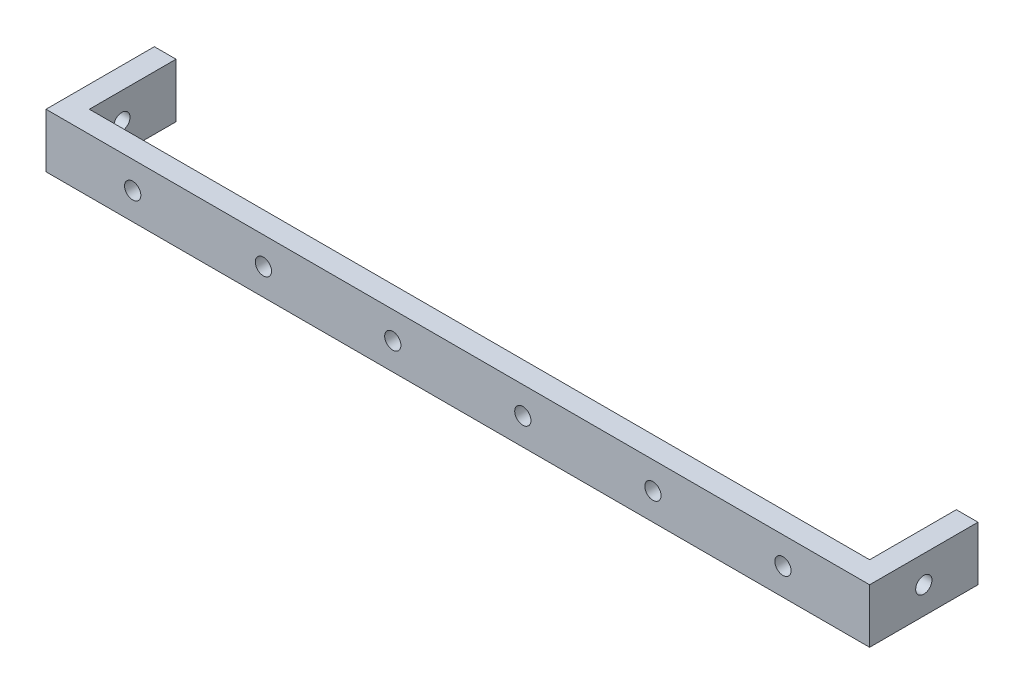
ISO-10303-21;
HEADER;
FILE_DESCRIPTION(('STEP AP214'),'2;1');
FILE_NAME('part.step','',(''),(''),'','','');
FILE_SCHEMA(('AUTOMOTIVE_DESIGN { 1 0 10303 214 1 1 1 1 }'));
ENDSEC;
DATA;
#1=APPLICATION_CONTEXT('core data for automotive mechanical design processes');
#2=APPLICATION_PROTOCOL_DEFINITION('international standard','automotive_design',2000,#1);
#3=PRODUCT_CONTEXT('',#1,'mechanical');
#4=PRODUCT('Part','Part','',(#3));
#5=PRODUCT_RELATED_PRODUCT_CATEGORY('part','',(#4));
#6=PRODUCT_DEFINITION_FORMATION('','',#4);
#7=PRODUCT_DEFINITION_CONTEXT('part definition',#1,'design');
#8=PRODUCT_DEFINITION('design','',#6,#7);
#9=PRODUCT_DEFINITION_SHAPE('','',#8);
#10=(LENGTH_UNIT() NAMED_UNIT(*) SI_UNIT(.MILLI.,.METRE.));
#11=(NAMED_UNIT(*) PLANE_ANGLE_UNIT() SI_UNIT($,.RADIAN.));
#12=(NAMED_UNIT(*) SI_UNIT($,.STERADIAN.) SOLID_ANGLE_UNIT());
#13=UNCERTAINTY_MEASURE_WITH_UNIT(LENGTH_MEASURE(1.E-05),#10,'distance_accuracy_value','');
#14=(GEOMETRIC_REPRESENTATION_CONTEXT(3) GLOBAL_UNCERTAINTY_ASSIGNED_CONTEXT((#13)) GLOBAL_UNIT_ASSIGNED_CONTEXT((#10,
#11,#12)) REPRESENTATION_CONTEXT('',''));
#15=CARTESIAN_POINT('',(0.,0.,0.));
#16=DIRECTION('',(0.,0.,1.));
#17=DIRECTION('',(1.,0.,0.));
#18=AXIS2_PLACEMENT_3D('',#15,#16,#17);
#19=CARTESIAN_POINT('',(0.,0.,2.));
#20=DIRECTION('',(0.,1.,0.));
#21=DIRECTION('',(0.,0.,1.));
#22=AXIS2_PLACEMENT_3D('',#19,#20,#21);
#23=PLANE('',#22);
#24=DIRECTION('',(1.,0.,0.));
#25=VECTOR('',#24,1.);
#26=CARTESIAN_POINT('',(0.,0.,0.));
#27=LINE('',#26,#25);
#28=CARTESIAN_POINT('',(0.,0.,0.));
#29=VERTEX_POINT('',#28);
#30=CARTESIAN_POINT('',(72.,0.,0.));
#31=VERTEX_POINT('',#30);
#32=EDGE_CURVE('E62',#29,#31,#27,.T.);
#33=ORIENTED_EDGE('',*,*,#32,.T.);
#34=DIRECTION('',(0.,0.,-1.));
#35=VECTOR('',#34,1.);
#36=CARTESIAN_POINT('',(72.,0.,2.));
#37=LINE('',#36,#35);
#38=CARTESIAN_POINT('',(72.,0.,-8.));
#39=VERTEX_POINT('',#38);
#40=EDGE_CURVE('E156',#31,#39,#37,.T.);
#41=ORIENTED_EDGE('',*,*,#40,.T.);
#42=DIRECTION('',(-1.,0.,0.));
#43=VECTOR('',#42,1.);
#44=CARTESIAN_POINT('',(74.,0.,-8.));
#45=LINE('',#44,#43);
#46=CARTESIAN_POINT('',(74.,0.,-8.));
#47=VERTEX_POINT('',#46);
#48=EDGE_CURVE('E183',#47,#39,#45,.T.);
#49=ORIENTED_EDGE('',*,*,#48,.F.);
#50=DIRECTION('',(0.,0.,-1.));
#51=VECTOR('',#50,1.);
#52=CARTESIAN_POINT('',(74.,0.,2.));
#53=LINE('',#52,#51);
#54=CARTESIAN_POINT('',(74.,0.,2.));
#55=VERTEX_POINT('',#54);
#56=EDGE_CURVE('E162',#55,#47,#53,.T.);
#57=ORIENTED_EDGE('',*,*,#56,.F.);
#58=DIRECTION('',(1.,0.,0.));
#59=VECTOR('',#58,1.);
#60=CARTESIAN_POINT('',(0.,0.,2.));
#61=LINE('',#60,#59);
#62=CARTESIAN_POINT('',(-2.,0.,2.));
#63=VERTEX_POINT('',#62);
#64=EDGE_CURVE('E47',#63,#55,#61,.T.);
#65=ORIENTED_EDGE('',*,*,#64,.F.);
#66=DIRECTION('',(0.,0.,1.));
#67=VECTOR('',#66,1.);
#68=CARTESIAN_POINT('',(-2.,0.,2.));
#69=LINE('',#68,#67);
#70=CARTESIAN_POINT('',(-2.,0.,-8.));
#71=VERTEX_POINT('',#70);
#72=EDGE_CURVE('E124',#71,#63,#69,.T.);
#73=ORIENTED_EDGE('',*,*,#72,.F.);
#74=DIRECTION('',(1.,0.,0.));
#75=VECTOR('',#74,1.);
#76=CARTESIAN_POINT('',(-2.,0.,-8.));
#77=LINE('',#76,#75);
#78=CARTESIAN_POINT('',(0.,0.,-8.));
#79=VERTEX_POINT('',#78);
#80=EDGE_CURVE('E139',#71,#79,#77,.T.);
#81=ORIENTED_EDGE('',*,*,#80,.T.);
#82=DIRECTION('',(0.,0.,1.));
#83=VECTOR('',#82,1.);
#84=CARTESIAN_POINT('',(0.,0.,2.));
#85=LINE('',#84,#83);
#86=EDGE_CURVE('E126',#79,#29,#85,.T.);
#87=ORIENTED_EDGE('',*,*,#86,.T.);
#88=EDGE_LOOP('',(#33,#41,#49,#57,#65,#73,#81,#87));
#89=FACE_BOUND('',#88,.T.);
#90=ADVANCED_FACE('F38',(#89),#23,.F.);
#91=CARTESIAN_POINT('',(0.,5.,2.));
#92=DIRECTION('',(0.,-1.,0.));
#93=DIRECTION('',(0.,0.,-1.));
#94=AXIS2_PLACEMENT_3D('',#91,#92,#93);
#95=PLANE('',#94);
#96=DIRECTION('',(-1.,0.,0.));
#97=VECTOR('',#96,1.);
#98=CARTESIAN_POINT('',(0.,5.,0.));
#99=LINE('',#98,#97);
#100=CARTESIAN_POINT('',(72.,5.,0.));
#101=VERTEX_POINT('',#100);
#102=CARTESIAN_POINT('',(0.,5.,0.));
#103=VERTEX_POINT('',#102);
#104=EDGE_CURVE('E41',#101,#103,#99,.T.);
#105=ORIENTED_EDGE('',*,*,#104,.T.);
#106=DIRECTION('',(0.,0.,-1.));
#107=VECTOR('',#106,1.);
#108=CARTESIAN_POINT('',(0.,5.,2.));
#109=LINE('',#108,#107);
#110=CARTESIAN_POINT('',(0.,5.,-8.));
#111=VERTEX_POINT('',#110);
#112=EDGE_CURVE('E140',#103,#111,#109,.T.);
#113=ORIENTED_EDGE('',*,*,#112,.T.);
#114=DIRECTION('',(1.,0.,0.));
#115=VECTOR('',#114,1.);
#116=CARTESIAN_POINT('',(-2.,5.,-8.));
#117=LINE('',#116,#115);
#118=CARTESIAN_POINT('',(-2.,5.,-8.));
#119=VERTEX_POINT('',#118);
#120=EDGE_CURVE('E115',#119,#111,#117,.T.);
#121=ORIENTED_EDGE('',*,*,#120,.F.);
#122=DIRECTION('',(0.,0.,-1.));
#123=VECTOR('',#122,1.);
#124=CARTESIAN_POINT('',(-2.,5.,2.));
#125=LINE('',#124,#123);
#126=CARTESIAN_POINT('',(-2.,5.,2.));
#127=VERTEX_POINT('',#126);
#128=EDGE_CURVE('E112',#127,#119,#125,.T.);
#129=ORIENTED_EDGE('',*,*,#128,.F.);
#130=DIRECTION('',(-1.,0.,0.));
#131=VECTOR('',#130,1.);
#132=CARTESIAN_POINT('',(0.,5.,2.));
#133=LINE('',#132,#131);
#134=CARTESIAN_POINT('',(74.,5.,2.));
#135=VERTEX_POINT('',#134);
#136=EDGE_CURVE('E11',#135,#127,#133,.T.);
#137=ORIENTED_EDGE('',*,*,#136,.F.);
#138=DIRECTION('',(0.,0.,1.));
#139=VECTOR('',#138,1.);
#140=CARTESIAN_POINT('',(74.,5.,2.));
#141=LINE('',#140,#139);
#142=CARTESIAN_POINT('',(74.,5.,-8.));
#143=VERTEX_POINT('',#142);
#144=EDGE_CURVE('E169',#143,#135,#141,.T.);
#145=ORIENTED_EDGE('',*,*,#144,.F.);
#146=DIRECTION('',(-1.,0.,0.));
#147=VECTOR('',#146,1.);
#148=CARTESIAN_POINT('',(74.,5.,-8.));
#149=LINE('',#148,#147);
#150=CARTESIAN_POINT('',(72.,5.,-8.));
#151=VERTEX_POINT('',#150);
#152=EDGE_CURVE('E172',#143,#151,#149,.T.);
#153=ORIENTED_EDGE('',*,*,#152,.T.);
#154=DIRECTION('',(0.,0.,1.));
#155=VECTOR('',#154,1.);
#156=CARTESIAN_POINT('',(72.,5.,2.));
#157=LINE('',#156,#155);
#158=EDGE_CURVE('E163',#151,#101,#157,.T.);
#159=ORIENTED_EDGE('',*,*,#158,.T.);
#160=EDGE_LOOP('',(#105,#113,#121,#129,#137,#145,#153,#159));
#161=FACE_BOUND('',#160,.T.);
#162=ADVANCED_FACE('F113',(#161),#95,.F.);
#163=CARTESIAN_POINT('',(0.,0.,2.));
#164=DIRECTION('',(0.,0.,-1.));
#165=DIRECTION('',(-1.,0.,0.));
#166=AXIS2_PLACEMENT_3D('',#163,#164,#165);
#167=PLANE('',#166);
#168=CARTESIAN_POINT('',(6.,2.5,2.));
#169=DIRECTION('',(0.,0.,1.));
#170=DIRECTION('',(1.,0.,0.));
#171=AXIS2_PLACEMENT_3D('',#168,#169,#170);
#172=CIRCLE('',#171,0.749999999999998);
#173=CARTESIAN_POINT('',(6.75,2.5,2.));
#174=VERTEX_POINT('',#173);
#175=EDGE_CURVE('E221',#174,#174,#172,.T.);
#176=ORIENTED_EDGE('',*,*,#175,.F.);
#177=EDGE_LOOP('',(#176));
#178=FACE_BOUND('',#177,.T.);
#179=CARTESIAN_POINT('',(66.,2.5,2.));
#180=DIRECTION('',(0.,0.,1.));
#181=DIRECTION('',(1.,0.,0.));
#182=AXIS2_PLACEMENT_3D('',#179,#180,#181);
#183=CIRCLE('',#182,0.749999999999999);
#184=CARTESIAN_POINT('',(66.75,2.5,2.));
#185=VERTEX_POINT('',#184);
#186=EDGE_CURVE('E213',#185,#185,#183,.T.);
#187=ORIENTED_EDGE('',*,*,#186,.F.);
#188=EDGE_LOOP('',(#187));
#189=FACE_BOUND('',#188,.T.);
#190=CARTESIAN_POINT('',(54.,2.5,2.));
#191=DIRECTION('',(0.,0.,1.));
#192=DIRECTION('',(1.,0.,0.));
#193=AXIS2_PLACEMENT_3D('',#190,#191,#192);
#194=CIRCLE('',#193,0.749999999999999);
#195=CARTESIAN_POINT('',(54.75,2.5,2.));
#196=VERTEX_POINT('',#195);
#197=EDGE_CURVE('E205',#196,#196,#194,.T.);
#198=ORIENTED_EDGE('',*,*,#197,.F.);
#199=EDGE_LOOP('',(#198));
#200=FACE_BOUND('',#199,.T.);
#201=CARTESIAN_POINT('',(18.0602404404208,2.46359958582028,2.));
#202=DIRECTION('',(0.,0.,1.));
#203=DIRECTION('',(1.,0.,0.));
#204=AXIS2_PLACEMENT_3D('',#201,#202,#203);
#205=CIRCLE('',#204,0.749999999999999);
#206=CARTESIAN_POINT('',(18.8102404404208,2.46359958582028,2.));
#207=VERTEX_POINT('',#206);
#208=EDGE_CURVE('E197',#207,#207,#205,.T.);
#209=ORIENTED_EDGE('',*,*,#208,.F.);
#210=EDGE_LOOP('',(#209));
#211=FACE_BOUND('',#210,.T.);
#212=CARTESIAN_POINT('',(30.,2.5,2.));
#213=DIRECTION('',(0.,0.,1.));
#214=DIRECTION('',(1.,0.,0.));
#215=AXIS2_PLACEMENT_3D('',#212,#213,#214);
#216=CIRCLE('',#215,0.749999999999998);
#217=CARTESIAN_POINT('',(30.75,2.5,2.));
#218=VERTEX_POINT('',#217);
#219=EDGE_CURVE('E188',#218,#218,#216,.T.);
#220=ORIENTED_EDGE('',*,*,#219,.F.);
#221=EDGE_LOOP('',(#220));
#222=FACE_BOUND('',#221,.T.);
#223=CARTESIAN_POINT('',(42.,2.5,2.));
#224=DIRECTION('',(0.,0.,1.));
#225=DIRECTION('',(1.,0.,0.));
#226=AXIS2_PLACEMENT_3D('',#223,#224,#225);
#227=CIRCLE('',#226,0.749999999999999);
#228=CARTESIAN_POINT('',(42.75,2.5,2.));
#229=VERTEX_POINT('',#228);
#230=EDGE_CURVE('E228',#229,#229,#227,.T.);
#231=ORIENTED_EDGE('',*,*,#230,.F.);
#232=EDGE_LOOP('',(#231));
#233=FACE_BOUND('',#232,.T.);
#234=ORIENTED_EDGE('',*,*,#136,.T.);
#235=DIRECTION('',(0.,1.,0.));
#236=VECTOR('',#235,1.);
#237=CARTESIAN_POINT('',(-2.,0.,2.));
#238=LINE('',#237,#236);
#239=EDGE_CURVE('E106',#63,#127,#238,.T.);
#240=ORIENTED_EDGE('',*,*,#239,.F.);
#241=ORIENTED_EDGE('',*,*,#64,.T.);
#242=DIRECTION('',(0.,-1.,0.));
#243=VECTOR('',#242,1.);
#244=CARTESIAN_POINT('',(74.,5.,2.));
#245=LINE('',#244,#243);
#246=EDGE_CURVE('E108',#135,#55,#245,.T.);
#247=ORIENTED_EDGE('',*,*,#246,.F.);
#248=EDGE_LOOP('',(#234,#240,#241,#247));
#249=FACE_BOUND('',#248,.T.);
#250=ADVANCED_FACE('F104',(#178,#189,#200,#211,#222,#233,#249),#167,.F.);
#251=CARTESIAN_POINT('',(0.,0.,0.));
#252=DIRECTION('',(0.,0.,-1.));
#253=DIRECTION('',(-1.,0.,0.));
#254=AXIS2_PLACEMENT_3D('',#251,#252,#253);
#255=PLANE('',#254);
#256=CARTESIAN_POINT('',(6.,2.5,0.));
#257=DIRECTION('',(0.,0.,1.));
#258=DIRECTION('',(1.,0.,0.));
#259=AXIS2_PLACEMENT_3D('',#256,#257,#258);
#260=CIRCLE('',#259,0.749999999999998);
#261=CARTESIAN_POINT('',(6.75,2.5,0.));
#262=VERTEX_POINT('',#261);
#263=EDGE_CURVE('E187',#262,#262,#260,.T.);
#264=ORIENTED_EDGE('',*,*,#263,.T.);
#265=EDGE_LOOP('',(#264));
#266=FACE_BOUND('',#265,.T.);
#267=CARTESIAN_POINT('',(66.,2.5,0.));
#268=DIRECTION('',(0.,0.,1.));
#269=DIRECTION('',(1.,0.,0.));
#270=AXIS2_PLACEMENT_3D('',#267,#268,#269);
#271=CIRCLE('',#270,0.749999999999999);
#272=CARTESIAN_POINT('',(66.75,2.5,0.));
#273=VERTEX_POINT('',#272);
#274=EDGE_CURVE('E217',#273,#273,#271,.T.);
#275=ORIENTED_EDGE('',*,*,#274,.T.);
#276=EDGE_LOOP('',(#275));
#277=FACE_BOUND('',#276,.T.);
#278=CARTESIAN_POINT('',(54.,2.5,0.));
#279=DIRECTION('',(0.,0.,1.));
#280=DIRECTION('',(1.,0.,0.));
#281=AXIS2_PLACEMENT_3D('',#278,#279,#280);
#282=CIRCLE('',#281,0.749999999999999);
#283=CARTESIAN_POINT('',(54.75,2.5,0.));
#284=VERTEX_POINT('',#283);
#285=EDGE_CURVE('E209',#284,#284,#282,.T.);
#286=ORIENTED_EDGE('',*,*,#285,.T.);
#287=EDGE_LOOP('',(#286));
#288=FACE_BOUND('',#287,.T.);
#289=CARTESIAN_POINT('',(18.0602404404208,2.46359958582028,0.));
#290=DIRECTION('',(0.,0.,1.));
#291=DIRECTION('',(1.,0.,0.));
#292=AXIS2_PLACEMENT_3D('',#289,#290,#291);
#293=CIRCLE('',#292,0.749999999999999);
#294=CARTESIAN_POINT('',(18.8102404404208,2.46359958582028,0.));
#295=VERTEX_POINT('',#294);
#296=EDGE_CURVE('E201',#295,#295,#293,.T.);
#297=ORIENTED_EDGE('',*,*,#296,.T.);
#298=EDGE_LOOP('',(#297));
#299=FACE_BOUND('',#298,.T.);
#300=CARTESIAN_POINT('',(30.,2.5,0.));
#301=DIRECTION('',(0.,0.,1.));
#302=DIRECTION('',(1.,0.,0.));
#303=AXIS2_PLACEMENT_3D('',#300,#301,#302);
#304=CIRCLE('',#303,0.749999999999998);
#305=CARTESIAN_POINT('',(30.75,2.5,0.));
#306=VERTEX_POINT('',#305);
#307=EDGE_CURVE('E193',#306,#306,#304,.T.);
#308=ORIENTED_EDGE('',*,*,#307,.T.);
#309=EDGE_LOOP('',(#308));
#310=FACE_BOUND('',#309,.T.);
#311=CARTESIAN_POINT('',(42.,2.5,0.));
#312=DIRECTION('',(0.,0.,1.));
#313=DIRECTION('',(1.,0.,0.));
#314=AXIS2_PLACEMENT_3D('',#311,#312,#313);
#315=CIRCLE('',#314,0.749999999999999);
#316=CARTESIAN_POINT('',(42.75,2.5,0.));
#317=VERTEX_POINT('',#316);
#318=EDGE_CURVE('E192',#317,#317,#315,.T.);
#319=ORIENTED_EDGE('',*,*,#318,.T.);
#320=EDGE_LOOP('',(#319));
#321=FACE_BOUND('',#320,.T.);
#322=DIRECTION('',(0.,-1.,0.));
#323=VECTOR('',#322,1.);
#324=CARTESIAN_POINT('',(0.,0.,0.));
#325=LINE('',#324,#323);
#326=EDGE_CURVE('E232',#103,#29,#325,.T.);
#327=ORIENTED_EDGE('',*,*,#326,.F.);
#328=ORIENTED_EDGE('',*,*,#104,.F.);
#329=DIRECTION('',(0.,1.,0.));
#330=VECTOR('',#329,1.);
#331=CARTESIAN_POINT('',(72.,0.,0.));
#332=LINE('',#331,#330);
#333=EDGE_CURVE('E242',#31,#101,#332,.T.);
#334=ORIENTED_EDGE('',*,*,#333,.F.);
#335=ORIENTED_EDGE('',*,*,#32,.F.);
#336=EDGE_LOOP('',(#327,#328,#334,#335));
#337=FACE_BOUND('',#336,.T.);
#338=ADVANCED_FACE('F281',(#266,#277,#288,#299,#310,#321,#337),#255,.T.);
#339=CARTESIAN_POINT('',(42.,2.5,2.));
#340=DIRECTION('',(0.,0.,-1.));
#341=DIRECTION('',(-1.,0.,0.));
#342=AXIS2_PLACEMENT_3D('',#339,#340,#341);
#343=CYLINDRICAL_SURFACE('',#342,0.749999999999999);
#344=ORIENTED_EDGE('',*,*,#230,.T.);
#345=EDGE_LOOP('',(#344));
#346=FACE_BOUND('',#345,.T.);
#347=ORIENTED_EDGE('',*,*,#318,.F.);
#348=EDGE_LOOP('',(#347));
#349=FACE_BOUND('',#348,.T.);
#350=ADVANCED_FACE('F286',(#346,#349),#343,.F.);
#351=CARTESIAN_POINT('',(30.,2.5,2.));
#352=DIRECTION('',(0.,0.,-1.));
#353=DIRECTION('',(-1.,0.,0.));
#354=AXIS2_PLACEMENT_3D('',#351,#352,#353);
#355=CYLINDRICAL_SURFACE('',#354,0.749999999999998);
#356=ORIENTED_EDGE('',*,*,#219,.T.);
#357=EDGE_LOOP('',(#356));
#358=FACE_BOUND('',#357,.T.);
#359=ORIENTED_EDGE('',*,*,#307,.F.);
#360=EDGE_LOOP('',(#359));
#361=FACE_BOUND('',#360,.T.);
#362=ADVANCED_FACE('F291',(#358,#361),#355,.F.);
#363=CARTESIAN_POINT('',(18.0602404404208,2.46359958582028,2.));
#364=DIRECTION('',(0.,0.,-1.));
#365=DIRECTION('',(-1.,0.,0.));
#366=AXIS2_PLACEMENT_3D('',#363,#364,#365);
#367=CYLINDRICAL_SURFACE('',#366,0.749999999999999);
#368=ORIENTED_EDGE('',*,*,#208,.T.);
#369=EDGE_LOOP('',(#368));
#370=FACE_BOUND('',#369,.T.);
#371=ORIENTED_EDGE('',*,*,#296,.F.);
#372=EDGE_LOOP('',(#371));
#373=FACE_BOUND('',#372,.T.);
#374=ADVANCED_FACE('F304',(#370,#373),#367,.F.);
#375=CARTESIAN_POINT('',(54.,2.5,2.));
#376=DIRECTION('',(0.,0.,-1.));
#377=DIRECTION('',(-1.,0.,0.));
#378=AXIS2_PLACEMENT_3D('',#375,#376,#377);
#379=CYLINDRICAL_SURFACE('',#378,0.749999999999999);
#380=ORIENTED_EDGE('',*,*,#197,.T.);
#381=EDGE_LOOP('',(#380));
#382=FACE_BOUND('',#381,.T.);
#383=ORIENTED_EDGE('',*,*,#285,.F.);
#384=EDGE_LOOP('',(#383));
#385=FACE_BOUND('',#384,.T.);
#386=ADVANCED_FACE('F300',(#382,#385),#379,.F.);
#387=CARTESIAN_POINT('',(66.,2.5,2.));
#388=DIRECTION('',(0.,0.,-1.));
#389=DIRECTION('',(-1.,0.,0.));
#390=AXIS2_PLACEMENT_3D('',#387,#388,#389);
#391=CYLINDRICAL_SURFACE('',#390,0.749999999999999);
#392=ORIENTED_EDGE('',*,*,#186,.T.);
#393=EDGE_LOOP('',(#392));
#394=FACE_BOUND('',#393,.T.);
#395=ORIENTED_EDGE('',*,*,#274,.F.);
#396=EDGE_LOOP('',(#395));
#397=FACE_BOUND('',#396,.T.);
#398=ADVANCED_FACE('F296',(#394,#397),#391,.F.);
#399=CARTESIAN_POINT('',(6.,2.5,2.));
#400=DIRECTION('',(0.,0.,-1.));
#401=DIRECTION('',(-1.,0.,0.));
#402=AXIS2_PLACEMENT_3D('',#399,#400,#401);
#403=CYLINDRICAL_SURFACE('',#402,0.749999999999998);
#404=ORIENTED_EDGE('',*,*,#175,.T.);
#405=EDGE_LOOP('',(#404));
#406=FACE_BOUND('',#405,.T.);
#407=ORIENTED_EDGE('',*,*,#263,.F.);
#408=EDGE_LOOP('',(#407));
#409=FACE_BOUND('',#408,.T.);
#410=ADVANCED_FACE('F293',(#406,#409),#403,.F.);
#411=CARTESIAN_POINT('',(72.,0.,0.));
#412=DIRECTION('',(1.,0.,0.));
#413=DIRECTION('',(0.,0.,-1.));
#414=AXIS2_PLACEMENT_3D('',#411,#412,#413);
#415=PLANE('',#414);
#416=CARTESIAN_POINT('',(72.,2.5,-3.));
#417=DIRECTION('',(1.,0.,0.));
#418=DIRECTION('',(0.,0.,-1.));
#419=AXIS2_PLACEMENT_3D('',#416,#417,#418);
#420=CIRCLE('',#419,0.75);
#421=CARTESIAN_POINT('',(72.,2.5,-3.75));
#422=VERTEX_POINT('',#421);
#423=EDGE_CURVE('E151',#422,#422,#420,.T.);
#424=ORIENTED_EDGE('',*,*,#423,.T.);
#425=EDGE_LOOP('',(#424));
#426=FACE_BOUND('',#425,.T.);
#427=ORIENTED_EDGE('',*,*,#40,.F.);
#428=ORIENTED_EDGE('',*,*,#333,.T.);
#429=ORIENTED_EDGE('',*,*,#158,.F.);
#430=DIRECTION('',(0.,1.,0.));
#431=VECTOR('',#430,1.);
#432=CARTESIAN_POINT('',(72.,5.,-8.));
#433=LINE('',#432,#431);
#434=EDGE_CURVE('E175',#39,#151,#433,.T.);
#435=ORIENTED_EDGE('',*,*,#434,.F.);
#436=EDGE_LOOP('',(#427,#428,#429,#435));
#437=FACE_BOUND('',#436,.T.);
#438=ADVANCED_FACE('F249',(#426,#437),#415,.F.);
#439=CARTESIAN_POINT('',(74.,5.,-8.));
#440=DIRECTION('',(0.,0.,1.));
#441=DIRECTION('',(1.,0.,0.));
#442=AXIS2_PLACEMENT_3D('',#439,#440,#441);
#443=PLANE('',#442);
#444=ORIENTED_EDGE('',*,*,#434,.T.);
#445=ORIENTED_EDGE('',*,*,#152,.F.);
#446=DIRECTION('',(0.,1.,0.));
#447=VECTOR('',#446,1.);
#448=CARTESIAN_POINT('',(74.,5.,-8.));
#449=LINE('',#448,#447);
#450=EDGE_CURVE('E166',#47,#143,#449,.T.);
#451=ORIENTED_EDGE('',*,*,#450,.F.);
#452=ORIENTED_EDGE('',*,*,#48,.T.);
#453=EDGE_LOOP('',(#444,#445,#451,#452));
#454=FACE_BOUND('',#453,.T.);
#455=ADVANCED_FACE('F255',(#454),#443,.F.);
#456=CARTESIAN_POINT('',(74.,0.,0.));
#457=DIRECTION('',(1.,0.,0.));
#458=DIRECTION('',(0.,0.,-1.));
#459=AXIS2_PLACEMENT_3D('',#456,#457,#458);
#460=PLANE('',#459);
#461=CARTESIAN_POINT('',(74.,2.5,-3.));
#462=DIRECTION('',(1.,0.,0.));
#463=DIRECTION('',(0.,0.,-1.));
#464=AXIS2_PLACEMENT_3D('',#461,#462,#463);
#465=CIRCLE('',#464,0.75);
#466=CARTESIAN_POINT('',(74.,2.5,-3.75));
#467=VERTEX_POINT('',#466);
#468=EDGE_CURVE('E152',#467,#467,#465,.T.);
#469=ORIENTED_EDGE('',*,*,#468,.F.);
#470=EDGE_LOOP('',(#469));
#471=FACE_BOUND('',#470,.T.);
#472=ORIENTED_EDGE('',*,*,#246,.T.);
#473=ORIENTED_EDGE('',*,*,#56,.T.);
#474=ORIENTED_EDGE('',*,*,#450,.T.);
#475=ORIENTED_EDGE('',*,*,#144,.T.);
#476=EDGE_LOOP('',(#472,#473,#474,#475));
#477=FACE_BOUND('',#476,.T.);
#478=ADVANCED_FACE('F259',(#471,#477),#460,.T.);
#479=CARTESIAN_POINT('',(74.,2.5,-3.));
#480=DIRECTION('',(-1.,0.,0.));
#481=DIRECTION('',(0.,0.,1.));
#482=AXIS2_PLACEMENT_3D('',#479,#480,#481);
#483=CYLINDRICAL_SURFACE('',#482,0.75);
#484=ORIENTED_EDGE('',*,*,#468,.T.);
#485=EDGE_LOOP('',(#484));
#486=FACE_BOUND('',#485,.T.);
#487=ORIENTED_EDGE('',*,*,#423,.F.);
#488=EDGE_LOOP('',(#487));
#489=FACE_BOUND('',#488,.T.);
#490=ADVANCED_FACE('F261',(#486,#489),#483,.F.);
#491=CARTESIAN_POINT('',(0.,0.,0.));
#492=DIRECTION('',(-1.,0.,0.));
#493=DIRECTION('',(0.,0.,1.));
#494=AXIS2_PLACEMENT_3D('',#491,#492,#493);
#495=PLANE('',#494);
#496=CARTESIAN_POINT('',(0.,2.5,-3.));
#497=DIRECTION('',(-1.,0.,0.));
#498=DIRECTION('',(0.,0.,1.));
#499=AXIS2_PLACEMENT_3D('',#496,#497,#498);
#500=CIRCLE('',#499,0.75);
#501=CARTESIAN_POINT('',(0.,2.5,-2.25));
#502=VERTEX_POINT('',#501);
#503=EDGE_CURVE('E132',#502,#502,#500,.T.);
#504=ORIENTED_EDGE('',*,*,#503,.T.);
#505=EDGE_LOOP('',(#504));
#506=FACE_BOUND('',#505,.T.);
#507=ORIENTED_EDGE('',*,*,#112,.F.);
#508=ORIENTED_EDGE('',*,*,#326,.T.);
#509=ORIENTED_EDGE('',*,*,#86,.F.);
#510=DIRECTION('',(0.,-1.,0.));
#511=VECTOR('',#510,1.);
#512=CARTESIAN_POINT('',(0.,0.,-8.));
#513=LINE('',#512,#511);
#514=EDGE_CURVE('E129',#111,#79,#513,.T.);
#515=ORIENTED_EDGE('',*,*,#514,.F.);
#516=EDGE_LOOP('',(#507,#508,#509,#515));
#517=FACE_BOUND('',#516,.T.);
#518=ADVANCED_FACE('F268',(#506,#517),#495,.F.);
#519=CARTESIAN_POINT('',(-2.,0.,-8.));
#520=DIRECTION('',(0.,0.,1.));
#521=DIRECTION('',(1.,0.,0.));
#522=AXIS2_PLACEMENT_3D('',#519,#520,#521);
#523=PLANE('',#522);
#524=ORIENTED_EDGE('',*,*,#514,.T.);
#525=ORIENTED_EDGE('',*,*,#80,.F.);
#526=DIRECTION('',(0.,-1.,0.));
#527=VECTOR('',#526,1.);
#528=CARTESIAN_POINT('',(-2.,0.,-8.));
#529=LINE('',#528,#527);
#530=EDGE_CURVE('E119',#119,#71,#529,.T.);
#531=ORIENTED_EDGE('',*,*,#530,.F.);
#532=ORIENTED_EDGE('',*,*,#120,.T.);
#533=EDGE_LOOP('',(#524,#525,#531,#532));
#534=FACE_BOUND('',#533,.T.);
#535=ADVANCED_FACE('F398',(#534),#523,.F.);
#536=CARTESIAN_POINT('',(-2.,0.,0.));
#537=DIRECTION('',(-1.,0.,0.));
#538=DIRECTION('',(0.,0.,1.));
#539=AXIS2_PLACEMENT_3D('',#536,#537,#538);
#540=PLANE('',#539);
#541=CARTESIAN_POINT('',(-2.,2.5,-3.));
#542=DIRECTION('',(-1.,0.,0.));
#543=DIRECTION('',(0.,0.,1.));
#544=AXIS2_PLACEMENT_3D('',#541,#542,#543);
#545=CIRCLE('',#544,0.75);
#546=CARTESIAN_POINT('',(-2.,2.5,-2.25));
#547=VERTEX_POINT('',#546);
#548=EDGE_CURVE('E143',#547,#547,#545,.T.);
#549=ORIENTED_EDGE('',*,*,#548,.F.);
#550=EDGE_LOOP('',(#549));
#551=FACE_BOUND('',#550,.T.);
#552=ORIENTED_EDGE('',*,*,#239,.T.);
#553=ORIENTED_EDGE('',*,*,#128,.T.);
#554=ORIENTED_EDGE('',*,*,#530,.T.);
#555=ORIENTED_EDGE('',*,*,#72,.T.);
#556=EDGE_LOOP('',(#552,#553,#554,#555));
#557=FACE_BOUND('',#556,.T.);
#558=ADVANCED_FACE('F122',(#551,#557),#540,.T.);
#559=CARTESIAN_POINT('',(-2.,2.5,-3.));
#560=DIRECTION('',(1.,0.,0.));
#561=DIRECTION('',(0.,0.,-1.));
#562=AXIS2_PLACEMENT_3D('',#559,#560,#561);
#563=CYLINDRICAL_SURFACE('',#562,0.75);
#564=ORIENTED_EDGE('',*,*,#548,.T.);
#565=EDGE_LOOP('',(#564));
#566=FACE_BOUND('',#565,.T.);
#567=ORIENTED_EDGE('',*,*,#503,.F.);
#568=EDGE_LOOP('',(#567));
#569=FACE_BOUND('',#568,.T.);
#570=ADVANCED_FACE('F411',(#566,#569),#563,.F.);
#571=CLOSED_SHELL('',(#90,#162,#250,#338,#350,#362,#374,#386,#398,#410,#438,#455,#478,#490,#518,
#535,#558,#570));
#572=MANIFOLD_SOLID_BREP('B2',#571);
#573=ADVANCED_BREP_SHAPE_REPRESENTATION('',(#18,#572),#14);
#574=SHAPE_DEFINITION_REPRESENTATION(#9,#573);
ENDSEC;
END-ISO-10303-21;
